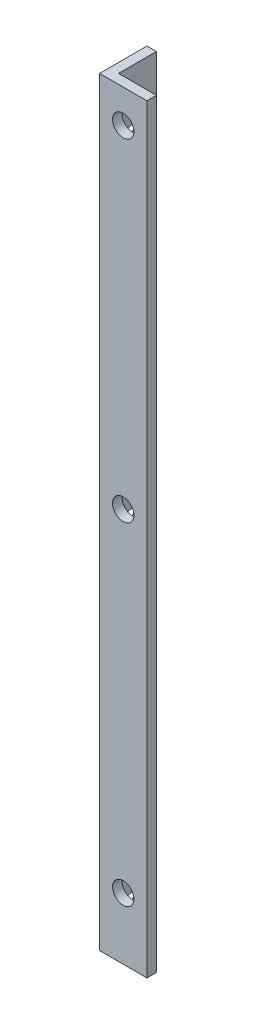
ISO-10303-21;
HEADER;
FILE_DESCRIPTION(('STEP AP214'),'2;1');
FILE_NAME('part.step','',(''),(''),'','','');
FILE_SCHEMA(('AUTOMOTIVE_DESIGN { 1 0 10303 214 1 1 1 1 }'));
ENDSEC;
DATA;
#1=APPLICATION_CONTEXT('core data for automotive mechanical design processes');
#2=APPLICATION_PROTOCOL_DEFINITION('international standard','automotive_design',2000,#1);
#3=PRODUCT_CONTEXT('',#1,'mechanical');
#4=PRODUCT('Part','Part','',(#3));
#5=PRODUCT_RELATED_PRODUCT_CATEGORY('part','',(#4));
#6=PRODUCT_DEFINITION_FORMATION('','',#4);
#7=PRODUCT_DEFINITION_CONTEXT('part definition',#1,'design');
#8=PRODUCT_DEFINITION('design','',#6,#7);
#9=PRODUCT_DEFINITION_SHAPE('','',#8);
#10=(LENGTH_UNIT() NAMED_UNIT(*) SI_UNIT(.MILLI.,.METRE.));
#11=(NAMED_UNIT(*) PLANE_ANGLE_UNIT() SI_UNIT($,.RADIAN.));
#12=(NAMED_UNIT(*) SI_UNIT($,.STERADIAN.) SOLID_ANGLE_UNIT());
#13=UNCERTAINTY_MEASURE_WITH_UNIT(LENGTH_MEASURE(1.E-05),#10,'distance_accuracy_value','');
#14=(GEOMETRIC_REPRESENTATION_CONTEXT(3) GLOBAL_UNCERTAINTY_ASSIGNED_CONTEXT((#13)) GLOBAL_UNIT_ASSIGNED_CONTEXT((#10,
#11,#12)) REPRESENTATION_CONTEXT('',''));
#15=CARTESIAN_POINT('',(0.,0.,0.));
#16=DIRECTION('',(0.,0.,1.));
#17=DIRECTION('',(1.,0.,0.));
#18=AXIS2_PLACEMENT_3D('',#15,#16,#17);
#19=CARTESIAN_POINT('',(2.,160.,-10.));
#20=DIRECTION('',(0.,0.,1.));
#21=DIRECTION('',(1.,0.,0.));
#22=AXIS2_PLACEMENT_3D('',#19,#20,#21);
#23=PLANE('',#22);
#24=DIRECTION('',(-1.,0.,0.));
#25=VECTOR('',#24,1.);
#26=CARTESIAN_POINT('',(2.,0.,-10.));
#27=LINE('',#26,#25);
#28=CARTESIAN_POINT('',(2.,0.,-10.));
#29=VERTEX_POINT('',#28);
#30=CARTESIAN_POINT('',(0.,0.,-10.));
#31=VERTEX_POINT('',#30);
#32=EDGE_CURVE('E115',#29,#31,#27,.T.);
#33=ORIENTED_EDGE('',*,*,#32,.T.);
#34=DIRECTION('',(0.,-1.,0.));
#35=VECTOR('',#34,1.);
#36=CARTESIAN_POINT('',(0.,160.,-10.));
#37=LINE('',#36,#35);
#38=CARTESIAN_POINT('',(0.,160.,-10.));
#39=VERTEX_POINT('',#38);
#40=EDGE_CURVE('E11',#39,#31,#37,.T.);
#41=ORIENTED_EDGE('',*,*,#40,.F.);
#42=DIRECTION('',(-1.,0.,0.));
#43=VECTOR('',#42,1.);
#44=CARTESIAN_POINT('',(2.,160.,-10.));
#45=LINE('',#44,#43);
#46=CARTESIAN_POINT('',(2.,160.,-10.));
#47=VERTEX_POINT('',#46);
#48=EDGE_CURVE('E126',#47,#39,#45,.T.);
#49=ORIENTED_EDGE('',*,*,#48,.F.);
#50=DIRECTION('',(0.,-1.,0.));
#51=VECTOR('',#50,1.);
#52=CARTESIAN_POINT('',(2.,160.,-10.));
#53=LINE('',#52,#51);
#54=EDGE_CURVE('E111',#47,#29,#53,.T.);
#55=ORIENTED_EDGE('',*,*,#54,.T.);
#56=EDGE_LOOP('',(#33,#41,#49,#55));
#57=FACE_BOUND('',#56,.T.);
#58=ADVANCED_FACE('F31',(#57),#23,.F.);
#59=CARTESIAN_POINT('',(0.,160.,-10.));
#60=DIRECTION('',(1.,0.,0.));
#61=DIRECTION('',(0.,0.,-1.));
#62=AXIS2_PLACEMENT_3D('',#59,#60,#61);
#63=PLANE('',#62);
#64=CARTESIAN_POINT('',(0.,147.,-5.));
#65=DIRECTION('',(-1.,0.,0.));
#66=DIRECTION('',(0.,0.,1.));
#67=AXIS2_PLACEMENT_3D('',#64,#65,#66);
#68=CIRCLE('',#67,2.25);
#69=CARTESIAN_POINT('',(0.,147.,-2.75));
#70=VERTEX_POINT('',#69);
#71=EDGE_CURVE('E266',#70,#70,#68,.T.);
#72=ORIENTED_EDGE('',*,*,#71,.F.);
#73=EDGE_LOOP('',(#72));
#74=FACE_BOUND('',#73,.T.);
#75=CARTESIAN_POINT('',(0.,77.,-5.));
#76=DIRECTION('',(-1.,0.,0.));
#77=DIRECTION('',(0.,0.,1.));
#78=AXIS2_PLACEMENT_3D('',#75,#76,#77);
#79=CIRCLE('',#78,2.25);
#80=CARTESIAN_POINT('',(0.,77.,-2.75));
#81=VERTEX_POINT('',#80);
#82=EDGE_CURVE('E269',#81,#81,#79,.T.);
#83=ORIENTED_EDGE('',*,*,#82,.F.);
#84=EDGE_LOOP('',(#83));
#85=FACE_BOUND('',#84,.T.);
#86=CARTESIAN_POINT('',(0.,6.99999999999998,-5.));
#87=DIRECTION('',(-1.,0.,0.));
#88=DIRECTION('',(0.,0.,1.));
#89=AXIS2_PLACEMENT_3D('',#86,#87,#88);
#90=CIRCLE('',#89,2.25);
#91=CARTESIAN_POINT('',(0.,6.99999999999998,-2.75));
#92=VERTEX_POINT('',#91);
#93=EDGE_CURVE('E278',#92,#92,#90,.T.);
#94=ORIENTED_EDGE('',*,*,#93,.F.);
#95=EDGE_LOOP('',(#94));
#96=FACE_BOUND('',#95,.T.);
#97=DIRECTION('',(0.,0.,1.));
#98=VECTOR('',#97,1.);
#99=CARTESIAN_POINT('',(0.,0.,-10.));
#100=LINE('',#99,#98);
#101=CARTESIAN_POINT('',(0.,0.,0.));
#102=VERTEX_POINT('',#101);
#103=EDGE_CURVE('E118',#31,#102,#100,.T.);
#104=ORIENTED_EDGE('',*,*,#103,.T.);
#105=DIRECTION('',(0.,-1.,0.));
#106=VECTOR('',#105,1.);
#107=CARTESIAN_POINT('',(0.,160.,0.));
#108=LINE('',#107,#106);
#109=CARTESIAN_POINT('',(0.,160.,0.));
#110=VERTEX_POINT('',#109);
#111=EDGE_CURVE('E39',#110,#102,#108,.T.);
#112=ORIENTED_EDGE('',*,*,#111,.F.);
#113=DIRECTION('',(0.,0.,1.));
#114=VECTOR('',#113,1.);
#115=CARTESIAN_POINT('',(0.,160.,-10.));
#116=LINE('',#115,#114);
#117=EDGE_CURVE('E84',#39,#110,#116,.T.);
#118=ORIENTED_EDGE('',*,*,#117,.F.);
#119=ORIENTED_EDGE('',*,*,#40,.T.);
#120=EDGE_LOOP('',(#104,#112,#118,#119));
#121=FACE_BOUND('',#120,.T.);
#122=ADVANCED_FACE('F154',(#74,#85,#96,#121),#63,.F.);
#123=CARTESIAN_POINT('',(0.,160.,0.));
#124=DIRECTION('',(0.,0.,-1.));
#125=DIRECTION('',(-1.,0.,0.));
#126=AXIS2_PLACEMENT_3D('',#123,#124,#125);
#127=PLANE('',#126);
#128=CARTESIAN_POINT('',(5.,153.,0.));
#129=DIRECTION('',(0.,0.,1.));
#130=DIRECTION('',(1.,0.,0.));
#131=AXIS2_PLACEMENT_3D('',#128,#129,#130);
#132=CIRCLE('',#131,2.25);
#133=CARTESIAN_POINT('',(7.25000000000001,153.,0.));
#134=VERTEX_POINT('',#133);
#135=EDGE_CURVE('E284',#134,#134,#132,.T.);
#136=ORIENTED_EDGE('',*,*,#135,.F.);
#137=EDGE_LOOP('',(#136));
#138=FACE_BOUND('',#137,.T.);
#139=CARTESIAN_POINT('',(5.,83.,0.));
#140=DIRECTION('',(0.,0.,1.));
#141=DIRECTION('',(1.,0.,0.));
#142=AXIS2_PLACEMENT_3D('',#139,#140,#141);
#143=CIRCLE('',#142,2.25);
#144=CARTESIAN_POINT('',(7.25000000000001,83.,0.));
#145=VERTEX_POINT('',#144);
#146=EDGE_CURVE('E290',#145,#145,#143,.T.);
#147=ORIENTED_EDGE('',*,*,#146,.F.);
#148=EDGE_LOOP('',(#147));
#149=FACE_BOUND('',#148,.T.);
#150=CARTESIAN_POINT('',(4.99999999999998,13.,0.));
#151=DIRECTION('',(0.,0.,1.));
#152=DIRECTION('',(1.,0.,0.));
#153=AXIS2_PLACEMENT_3D('',#150,#151,#152);
#154=CIRCLE('',#153,2.25);
#155=CARTESIAN_POINT('',(7.24999999999998,13.,0.));
#156=VERTEX_POINT('',#155);
#157=EDGE_CURVE('E296',#156,#156,#154,.T.);
#158=ORIENTED_EDGE('',*,*,#157,.F.);
#159=EDGE_LOOP('',(#158));
#160=FACE_BOUND('',#159,.T.);
#161=DIRECTION('',(1.,0.,0.));
#162=VECTOR('',#161,1.);
#163=CARTESIAN_POINT('',(0.,0.,0.));
#164=LINE('',#163,#162);
#165=CARTESIAN_POINT('',(10.,0.,0.));
#166=VERTEX_POINT('',#165);
#167=EDGE_CURVE('E121',#102,#166,#164,.T.);
#168=ORIENTED_EDGE('',*,*,#167,.T.);
#169=DIRECTION('',(0.,-1.,0.));
#170=VECTOR('',#169,1.);
#171=CARTESIAN_POINT('',(10.,160.,0.));
#172=LINE('',#171,#170);
#173=CARTESIAN_POINT('',(10.,160.,0.));
#174=VERTEX_POINT('',#173);
#175=EDGE_CURVE('E106',#174,#166,#172,.T.);
#176=ORIENTED_EDGE('',*,*,#175,.F.);
#177=DIRECTION('',(1.,0.,0.));
#178=VECTOR('',#177,1.);
#179=CARTESIAN_POINT('',(0.,160.,0.));
#180=LINE('',#179,#178);
#181=EDGE_CURVE('E97',#110,#174,#180,.T.);
#182=ORIENTED_EDGE('',*,*,#181,.F.);
#183=ORIENTED_EDGE('',*,*,#111,.T.);
#184=EDGE_LOOP('',(#168,#176,#182,#183));
#185=FACE_BOUND('',#184,.T.);
#186=ADVANCED_FACE('F132',(#138,#149,#160,#185),#127,.F.);
#187=CARTESIAN_POINT('',(10.,160.,0.));
#188=DIRECTION('',(-1.,0.,0.));
#189=DIRECTION('',(0.,0.,1.));
#190=AXIS2_PLACEMENT_3D('',#187,#188,#189);
#191=PLANE('',#190);
#192=DIRECTION('',(0.,0.,-1.));
#193=VECTOR('',#192,1.);
#194=CARTESIAN_POINT('',(10.,0.,0.));
#195=LINE('',#194,#193);
#196=CARTESIAN_POINT('',(10.,0.,-2.));
#197=VERTEX_POINT('',#196);
#198=EDGE_CURVE('E105',#166,#197,#195,.T.);
#199=ORIENTED_EDGE('',*,*,#198,.T.);
#200=DIRECTION('',(0.,-1.,0.));
#201=VECTOR('',#200,1.);
#202=CARTESIAN_POINT('',(10.,160.,-2.));
#203=LINE('',#202,#201);
#204=CARTESIAN_POINT('',(10.,160.,-2.));
#205=VERTEX_POINT('',#204);
#206=EDGE_CURVE('E102',#205,#197,#203,.T.);
#207=ORIENTED_EDGE('',*,*,#206,.F.);
#208=DIRECTION('',(0.,0.,-1.));
#209=VECTOR('',#208,1.);
#210=CARTESIAN_POINT('',(10.,160.,0.));
#211=LINE('',#210,#209);
#212=EDGE_CURVE('E91',#174,#205,#211,.T.);
#213=ORIENTED_EDGE('',*,*,#212,.F.);
#214=ORIENTED_EDGE('',*,*,#175,.T.);
#215=EDGE_LOOP('',(#199,#207,#213,#214));
#216=FACE_BOUND('',#215,.T.);
#217=ADVANCED_FACE('F103',(#216),#191,.F.);
#218=CARTESIAN_POINT('',(10.,160.,-2.));
#219=DIRECTION('',(0.,0.,1.));
#220=DIRECTION('',(1.,0.,0.));
#221=AXIS2_PLACEMENT_3D('',#218,#219,#220);
#222=PLANE('',#221);
#223=CARTESIAN_POINT('',(5.,153.,-2.));
#224=DIRECTION('',(0.,0.,1.));
#225=DIRECTION('',(1.,0.,0.));
#226=AXIS2_PLACEMENT_3D('',#223,#224,#225);
#227=CIRCLE('',#226,2.25);
#228=CARTESIAN_POINT('',(7.25000000000001,153.,-2.));
#229=VERTEX_POINT('',#228);
#230=EDGE_CURVE('E287',#229,#229,#227,.F.);
#231=ORIENTED_EDGE('',*,*,#230,.F.);
#232=EDGE_LOOP('',(#231));
#233=FACE_BOUND('',#232,.T.);
#234=CARTESIAN_POINT('',(5.,83.,-2.));
#235=DIRECTION('',(0.,0.,1.));
#236=DIRECTION('',(1.,0.,0.));
#237=AXIS2_PLACEMENT_3D('',#234,#235,#236);
#238=CIRCLE('',#237,2.25);
#239=CARTESIAN_POINT('',(7.25000000000001,83.,-2.));
#240=VERTEX_POINT('',#239);
#241=EDGE_CURVE('E293',#240,#240,#238,.F.);
#242=ORIENTED_EDGE('',*,*,#241,.F.);
#243=EDGE_LOOP('',(#242));
#244=FACE_BOUND('',#243,.T.);
#245=CARTESIAN_POINT('',(4.99999999999998,13.,-2.));
#246=DIRECTION('',(0.,0.,1.));
#247=DIRECTION('',(1.,0.,0.));
#248=AXIS2_PLACEMENT_3D('',#245,#246,#247);
#249=CIRCLE('',#248,2.25);
#250=CARTESIAN_POINT('',(7.24999999999998,13.,-2.));
#251=VERTEX_POINT('',#250);
#252=EDGE_CURVE('E119',#251,#251,#249,.F.);
#253=ORIENTED_EDGE('',*,*,#252,.F.);
#254=EDGE_LOOP('',(#253));
#255=FACE_BOUND('',#254,.T.);
#256=DIRECTION('',(-1.,0.,0.));
#257=VECTOR('',#256,1.);
#258=CARTESIAN_POINT('',(10.,0.,-2.));
#259=LINE('',#258,#257);
#260=CARTESIAN_POINT('',(2.,0.,-2.));
#261=VERTEX_POINT('',#260);
#262=EDGE_CURVE('E70',#197,#261,#259,.T.);
#263=ORIENTED_EDGE('',*,*,#262,.T.);
#264=DIRECTION('',(0.,-1.,0.));
#265=VECTOR('',#264,1.);
#266=CARTESIAN_POINT('',(2.,160.,-2.));
#267=LINE('',#266,#265);
#268=CARTESIAN_POINT('',(2.,160.,-2.));
#269=VERTEX_POINT('',#268);
#270=EDGE_CURVE('E107',#269,#261,#267,.T.);
#271=ORIENTED_EDGE('',*,*,#270,.F.);
#272=DIRECTION('',(-1.,0.,0.));
#273=VECTOR('',#272,1.);
#274=CARTESIAN_POINT('',(10.,160.,-2.));
#275=LINE('',#274,#273);
#276=EDGE_CURVE('E95',#205,#269,#275,.T.);
#277=ORIENTED_EDGE('',*,*,#276,.F.);
#278=ORIENTED_EDGE('',*,*,#206,.T.);
#279=EDGE_LOOP('',(#263,#271,#277,#278));
#280=FACE_BOUND('',#279,.T.);
#281=ADVANCED_FACE('F109',(#233,#244,#255,#280),#222,.F.);
#282=CARTESIAN_POINT('',(2.,160.,-2.));
#283=DIRECTION('',(-1.,0.,0.));
#284=DIRECTION('',(0.,0.,1.));
#285=AXIS2_PLACEMENT_3D('',#282,#283,#284);
#286=PLANE('',#285);
#287=CARTESIAN_POINT('',(2.,147.,-5.));
#288=DIRECTION('',(-1.,0.,0.));
#289=DIRECTION('',(0.,0.,1.));
#290=AXIS2_PLACEMENT_3D('',#287,#288,#289);
#291=CIRCLE('',#290,2.25);
#292=CARTESIAN_POINT('',(2.,147.,-2.75));
#293=VERTEX_POINT('',#292);
#294=EDGE_CURVE('E268',#293,#293,#291,.F.);
#295=ORIENTED_EDGE('',*,*,#294,.F.);
#296=EDGE_LOOP('',(#295));
#297=FACE_BOUND('',#296,.T.);
#298=CARTESIAN_POINT('',(2.,77.,-5.));
#299=DIRECTION('',(-1.,0.,0.));
#300=DIRECTION('',(0.,0.,1.));
#301=AXIS2_PLACEMENT_3D('',#298,#299,#300);
#302=CIRCLE('',#301,2.25);
#303=CARTESIAN_POINT('',(2.,77.,-2.75));
#304=VERTEX_POINT('',#303);
#305=EDGE_CURVE('E272',#304,#304,#302,.F.);
#306=ORIENTED_EDGE('',*,*,#305,.F.);
#307=EDGE_LOOP('',(#306));
#308=FACE_BOUND('',#307,.T.);
#309=CARTESIAN_POINT('',(2.,6.99999999999998,-5.));
#310=DIRECTION('',(-1.,0.,0.));
#311=DIRECTION('',(0.,0.,1.));
#312=AXIS2_PLACEMENT_3D('',#309,#310,#311);
#313=CIRCLE('',#312,2.25);
#314=CARTESIAN_POINT('',(2.,6.99999999999998,-2.75));
#315=VERTEX_POINT('',#314);
#316=EDGE_CURVE('E281',#315,#315,#313,.F.);
#317=ORIENTED_EDGE('',*,*,#316,.F.);
#318=EDGE_LOOP('',(#317));
#319=FACE_BOUND('',#318,.T.);
#320=DIRECTION('',(0.,0.,-1.));
#321=VECTOR('',#320,1.);
#322=CARTESIAN_POINT('',(2.,0.,-2.));
#323=LINE('',#322,#321);
#324=EDGE_CURVE('E76',#261,#29,#323,.T.);
#325=ORIENTED_EDGE('',*,*,#324,.T.);
#326=ORIENTED_EDGE('',*,*,#54,.F.);
#327=DIRECTION('',(0.,0.,-1.));
#328=VECTOR('',#327,1.);
#329=CARTESIAN_POINT('',(2.,160.,-2.));
#330=LINE('',#329,#328);
#331=EDGE_CURVE('E47',#269,#47,#330,.T.);
#332=ORIENTED_EDGE('',*,*,#331,.F.);
#333=ORIENTED_EDGE('',*,*,#270,.T.);
#334=EDGE_LOOP('',(#325,#326,#332,#333));
#335=FACE_BOUND('',#334,.T.);
#336=ADVANCED_FACE('F139',(#297,#308,#319,#335),#286,.F.);
#337=CARTESIAN_POINT('',(0.,160.,-10.));
#338=DIRECTION('',(0.,1.,0.));
#339=DIRECTION('',(0.,0.,1.));
#340=AXIS2_PLACEMENT_3D('',#337,#338,#339);
#341=PLANE('',#340);
#342=ORIENTED_EDGE('',*,*,#48,.T.);
#343=ORIENTED_EDGE('',*,*,#117,.T.);
#344=ORIENTED_EDGE('',*,*,#181,.T.);
#345=ORIENTED_EDGE('',*,*,#212,.T.);
#346=ORIENTED_EDGE('',*,*,#276,.T.);
#347=ORIENTED_EDGE('',*,*,#331,.T.);
#348=EDGE_LOOP('',(#342,#343,#344,#345,#346,#347));
#349=FACE_BOUND('',#348,.T.);
#350=ADVANCED_FACE('F93',(#349),#341,.T.);
#351=CARTESIAN_POINT('',(0.,0.,-10.));
#352=DIRECTION('',(0.,1.,0.));
#353=DIRECTION('',(0.,0.,1.));
#354=AXIS2_PLACEMENT_3D('',#351,#352,#353);
#355=PLANE('',#354);
#356=ORIENTED_EDGE('',*,*,#32,.F.);
#357=ORIENTED_EDGE('',*,*,#324,.F.);
#358=ORIENTED_EDGE('',*,*,#262,.F.);
#359=ORIENTED_EDGE('',*,*,#198,.F.);
#360=ORIENTED_EDGE('',*,*,#167,.F.);
#361=ORIENTED_EDGE('',*,*,#103,.F.);
#362=EDGE_LOOP('',(#356,#357,#358,#359,#360,#361));
#363=FACE_BOUND('',#362,.T.);
#364=ADVANCED_FACE('F135',(#363),#355,.F.);
#365=CARTESIAN_POINT('',(4.99999999999998,13.,-10.001));
#366=DIRECTION('',(0.,0.,1.));
#367=DIRECTION('',(1.,0.,0.));
#368=AXIS2_PLACEMENT_3D('',#365,#366,#367);
#369=CYLINDRICAL_SURFACE('',#368,2.25);
#370=ORIENTED_EDGE('',*,*,#157,.T.);
#371=EDGE_LOOP('',(#370));
#372=FACE_BOUND('',#371,.T.);
#373=ORIENTED_EDGE('',*,*,#252,.T.);
#374=EDGE_LOOP('',(#373));
#375=FACE_BOUND('',#374,.T.);
#376=ADVANCED_FACE('F186',(#372,#375),#369,.F.);
#377=CARTESIAN_POINT('',(5.,83.,-10.001));
#378=DIRECTION('',(0.,0.,1.));
#379=DIRECTION('',(1.,0.,0.));
#380=AXIS2_PLACEMENT_3D('',#377,#378,#379);
#381=CYLINDRICAL_SURFACE('',#380,2.25);
#382=ORIENTED_EDGE('',*,*,#146,.T.);
#383=EDGE_LOOP('',(#382));
#384=FACE_BOUND('',#383,.T.);
#385=ORIENTED_EDGE('',*,*,#241,.T.);
#386=EDGE_LOOP('',(#385));
#387=FACE_BOUND('',#386,.T.);
#388=ADVANCED_FACE('F191',(#384,#387),#381,.F.);
#389=CARTESIAN_POINT('',(5.,153.,-10.001));
#390=DIRECTION('',(0.,0.,1.));
#391=DIRECTION('',(1.,0.,0.));
#392=AXIS2_PLACEMENT_3D('',#389,#390,#391);
#393=CYLINDRICAL_SURFACE('',#392,2.25);
#394=ORIENTED_EDGE('',*,*,#135,.T.);
#395=EDGE_LOOP('',(#394));
#396=FACE_BOUND('',#395,.T.);
#397=ORIENTED_EDGE('',*,*,#230,.T.);
#398=EDGE_LOOP('',(#397));
#399=FACE_BOUND('',#398,.T.);
#400=ADVANCED_FACE('F203',(#396,#399),#393,.F.);
#401=CARTESIAN_POINT('',(10.001,6.99999999999998,-5.));
#402=DIRECTION('',(-1.,0.,0.));
#403=DIRECTION('',(0.,0.,1.));
#404=AXIS2_PLACEMENT_3D('',#401,#402,#403);
#405=CYLINDRICAL_SURFACE('',#404,2.25);
#406=ORIENTED_EDGE('',*,*,#93,.T.);
#407=EDGE_LOOP('',(#406));
#408=FACE_BOUND('',#407,.T.);
#409=ORIENTED_EDGE('',*,*,#316,.T.);
#410=EDGE_LOOP('',(#409));
#411=FACE_BOUND('',#410,.T.);
#412=ADVANCED_FACE('F212',(#408,#411),#405,.F.);
#413=CARTESIAN_POINT('',(10.001,77.,-5.));
#414=DIRECTION('',(-1.,0.,0.));
#415=DIRECTION('',(0.,0.,1.));
#416=AXIS2_PLACEMENT_3D('',#413,#414,#415);
#417=CYLINDRICAL_SURFACE('',#416,2.25);
#418=ORIENTED_EDGE('',*,*,#82,.T.);
#419=EDGE_LOOP('',(#418));
#420=FACE_BOUND('',#419,.T.);
#421=ORIENTED_EDGE('',*,*,#305,.T.);
#422=EDGE_LOOP('',(#421));
#423=FACE_BOUND('',#422,.T.);
#424=ADVANCED_FACE('F232',(#420,#423),#417,.F.);
#425=CARTESIAN_POINT('',(10.001,147.,-5.));
#426=DIRECTION('',(-1.,0.,0.));
#427=DIRECTION('',(0.,0.,1.));
#428=AXIS2_PLACEMENT_3D('',#425,#426,#427);
#429=CYLINDRICAL_SURFACE('',#428,2.25);
#430=ORIENTED_EDGE('',*,*,#71,.T.);
#431=EDGE_LOOP('',(#430));
#432=FACE_BOUND('',#431,.T.);
#433=ORIENTED_EDGE('',*,*,#294,.T.);
#434=EDGE_LOOP('',(#433));
#435=FACE_BOUND('',#434,.T.);
#436=ADVANCED_FACE('F242',(#432,#435),#429,.F.);
#437=CLOSED_SHELL('',(#58,#122,#186,#217,#281,#336,#350,#364,#376,#388,#400,#412,#424,#436));
#438=MANIFOLD_SOLID_BREP('B2',#437);
#439=ADVANCED_BREP_SHAPE_REPRESENTATION('',(#18,#438),#14);
#440=SHAPE_DEFINITION_REPRESENTATION(#9,#439);
ENDSEC;
END-ISO-10303-21;
